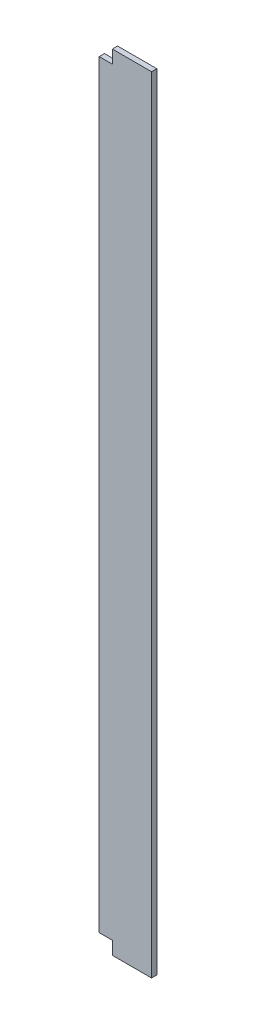
ISO-10303-21;
HEADER;
FILE_DESCRIPTION(('STEP AP214'),'2;1');
FILE_NAME('part.step','',(''),(''),'','','');
FILE_SCHEMA(('AUTOMOTIVE_DESIGN { 1 0 10303 214 1 1 1 1 }'));
ENDSEC;
DATA;
#1=APPLICATION_CONTEXT('core data for automotive mechanical design processes');
#2=APPLICATION_PROTOCOL_DEFINITION('international standard','automotive_design',2000,#1);
#3=PRODUCT_CONTEXT('',#1,'mechanical');
#4=PRODUCT('Part','Part','',(#3));
#5=PRODUCT_RELATED_PRODUCT_CATEGORY('part','',(#4));
#6=PRODUCT_DEFINITION_FORMATION('','',#4);
#7=PRODUCT_DEFINITION_CONTEXT('part definition',#1,'design');
#8=PRODUCT_DEFINITION('design','',#6,#7);
#9=PRODUCT_DEFINITION_SHAPE('','',#8);
#10=(LENGTH_UNIT() NAMED_UNIT(*) SI_UNIT(.MILLI.,.METRE.));
#11=(NAMED_UNIT(*) PLANE_ANGLE_UNIT() SI_UNIT($,.RADIAN.));
#12=(NAMED_UNIT(*) SI_UNIT($,.STERADIAN.) SOLID_ANGLE_UNIT());
#13=UNCERTAINTY_MEASURE_WITH_UNIT(LENGTH_MEASURE(1.E-05),#10,'distance_accuracy_value','');
#14=(GEOMETRIC_REPRESENTATION_CONTEXT(3) GLOBAL_UNCERTAINTY_ASSIGNED_CONTEXT((#13)) GLOBAL_UNIT_ASSIGNED_CONTEXT((#10,
#11,#12)) REPRESENTATION_CONTEXT('',''));
#15=CARTESIAN_POINT('',(0.,0.,0.));
#16=DIRECTION('',(0.,0.,1.));
#17=DIRECTION('',(1.,0.,0.));
#18=AXIS2_PLACEMENT_3D('',#15,#16,#17);
#19=CARTESIAN_POINT('',(-1156.48368854433,3000.,-804.687242443019));
#20=DIRECTION('',(1.,0.,0.));
#21=DIRECTION('',(0.,0.,-1.));
#22=AXIS2_PLACEMENT_3D('',#19,#20,#21);
#23=PLANE('',#22);
#24=DIRECTION('',(0.,-1.,0.));
#25=VECTOR('',#24,1.);
#26=CARTESIAN_POINT('',(-1156.48368854433,3000.,-784.687242443019));
#27=LINE('',#26,#25);
#28=CARTESIAN_POINT('',(-1156.48368854433,2950.,-784.687242443019));
#29=VERTEX_POINT('',#28);
#30=CARTESIAN_POINT('',(-1156.48368854433,50.,-784.687242443019));
#31=VERTEX_POINT('',#30);
#32=EDGE_CURVE('E11',#29,#31,#27,.T.);
#33=ORIENTED_EDGE('',*,*,#32,.F.);
#34=DIRECTION('',(0.,0.,1.));
#35=VECTOR('',#34,1.);
#36=CARTESIAN_POINT('',(-1156.48368854433,2950.,-804.687242443019));
#37=LINE('',#36,#35);
#38=CARTESIAN_POINT('',(-1156.48368854433,2950.,-804.687242443019));
#39=VERTEX_POINT('',#38);
#40=EDGE_CURVE('E109',#39,#29,#37,.T.);
#41=ORIENTED_EDGE('',*,*,#40,.F.);
#42=DIRECTION('',(0.,-1.,0.));
#43=VECTOR('',#42,1.);
#44=CARTESIAN_POINT('',(-1156.48368854433,3000.,-804.687242443019));
#45=LINE('',#44,#43);
#46=CARTESIAN_POINT('',(-1156.48368854433,50.,-804.687242443019));
#47=VERTEX_POINT('',#46);
#48=EDGE_CURVE('E126',#39,#47,#45,.T.);
#49=ORIENTED_EDGE('',*,*,#48,.T.);
#50=DIRECTION('',(0.,0.,1.));
#51=VECTOR('',#50,1.);
#52=CARTESIAN_POINT('',(-1156.48368854433,50.,-804.687242443019));
#53=LINE('',#52,#51);
#54=EDGE_CURVE('E180',#47,#31,#53,.T.);
#55=ORIENTED_EDGE('',*,*,#54,.T.);
#56=EDGE_LOOP('',(#33,#41,#49,#55));
#57=FACE_BOUND('',#56,.T.);
#58=ADVANCED_FACE('F38',(#57),#23,.F.);
#59=CARTESIAN_POINT('',(-1156.48368854433,3000.,-784.687242443019));
#60=DIRECTION('',(0.,0.,-1.));
#61=DIRECTION('',(-1.,0.,0.));
#62=AXIS2_PLACEMENT_3D('',#59,#60,#61);
#63=PLANE('',#62);
#64=DIRECTION('',(1.,0.,0.));
#65=VECTOR('',#64,1.);
#66=CARTESIAN_POINT('',(-1156.48368854433,3000.,-784.687242443019));
#67=LINE('',#66,#65);
#68=CARTESIAN_POINT('',(-1106.48368854433,3000.,-784.687242443019));
#69=VERTEX_POINT('',#68);
#70=CARTESIAN_POINT('',(-956.483688544326,3000.,-784.687242443019));
#71=VERTEX_POINT('',#70);
#72=EDGE_CURVE('E132',#69,#71,#67,.T.);
#73=ORIENTED_EDGE('',*,*,#72,.F.);
#74=DIRECTION('',(0.,1.,0.));
#75=VECTOR('',#74,1.);
#76=CARTESIAN_POINT('',(-1106.48368854433,3000.,-784.687242443019));
#77=LINE('',#76,#75);
#78=CARTESIAN_POINT('',(-1106.48368854433,2950.,-784.687242443019));
#79=VERTEX_POINT('',#78);
#80=EDGE_CURVE('E53',#79,#69,#77,.T.);
#81=ORIENTED_EDGE('',*,*,#80,.F.);
#82=DIRECTION('',(1.,0.,0.));
#83=VECTOR('',#82,1.);
#84=CARTESIAN_POINT('',(-1106.48368854433,2950.,-784.687242443019));
#85=LINE('',#84,#83);
#86=EDGE_CURVE('E119',#29,#79,#85,.T.);
#87=ORIENTED_EDGE('',*,*,#86,.F.);
#88=ORIENTED_EDGE('',*,*,#32,.T.);
#89=DIRECTION('',(-1.,0.,0.));
#90=VECTOR('',#89,1.);
#91=CARTESIAN_POINT('',(-1106.48368854433,50.,-784.687242443019));
#92=LINE('',#91,#90);
#93=CARTESIAN_POINT('',(-1106.48368854433,50.,-784.687242443019));
#94=VERTEX_POINT('',#93);
#95=EDGE_CURVE('E163',#94,#31,#92,.T.);
#96=ORIENTED_EDGE('',*,*,#95,.F.);
#97=DIRECTION('',(0.,1.,0.));
#98=VECTOR('',#97,1.);
#99=CARTESIAN_POINT('',(-1106.48368854433,0.,-784.687242443019));
#100=LINE('',#99,#98);
#101=CARTESIAN_POINT('',(-1106.48368854433,0.,-784.687242443019));
#102=VERTEX_POINT('',#101);
#103=EDGE_CURVE('E170',#102,#94,#100,.T.);
#104=ORIENTED_EDGE('',*,*,#103,.F.);
#105=DIRECTION('',(1.,0.,0.));
#106=VECTOR('',#105,1.);
#107=CARTESIAN_POINT('',(-1156.48368854433,0.,-784.687242443019));
#108=LINE('',#107,#106);
#109=CARTESIAN_POINT('',(-956.483688544326,0.,-784.687242443019));
#110=VERTEX_POINT('',#109);
#111=EDGE_CURVE('E136',#102,#110,#108,.T.);
#112=ORIENTED_EDGE('',*,*,#111,.T.);
#113=DIRECTION('',(0.,-1.,0.));
#114=VECTOR('',#113,1.);
#115=CARTESIAN_POINT('',(-956.483688544326,3000.,-784.687242443019));
#116=LINE('',#115,#114);
#117=EDGE_CURVE('E46',#71,#110,#116,.T.);
#118=ORIENTED_EDGE('',*,*,#117,.F.);
#119=EDGE_LOOP('',(#73,#81,#87,#88,#96,#104,#112,#118));
#120=FACE_BOUND('',#119,.T.);
#121=ADVANCED_FACE('F186',(#120),#63,.F.);
#122=CARTESIAN_POINT('',(-956.483688544326,3000.,-804.687242443019));
#123=DIRECTION('',(1.,0.,0.));
#124=DIRECTION('',(0.,0.,-1.));
#125=AXIS2_PLACEMENT_3D('',#122,#123,#124);
#126=PLANE('',#125);
#127=DIRECTION('',(0.,0.,1.));
#128=VECTOR('',#127,1.);
#129=CARTESIAN_POINT('',(-956.483688544326,0.,-804.687242443019));
#130=LINE('',#129,#128);
#131=CARTESIAN_POINT('',(-956.483688544326,0.,-804.687242443019));
#132=VERTEX_POINT('',#131);
#133=EDGE_CURVE('E139',#132,#110,#130,.T.);
#134=ORIENTED_EDGE('',*,*,#133,.F.);
#135=DIRECTION('',(0.,-1.,0.));
#136=VECTOR('',#135,1.);
#137=CARTESIAN_POINT('',(-956.483688544326,3000.,-804.687242443019));
#138=LINE('',#137,#136);
#139=CARTESIAN_POINT('',(-956.483688544326,3000.,-804.687242443019));
#140=VERTEX_POINT('',#139);
#141=EDGE_CURVE('E130',#140,#132,#138,.T.);
#142=ORIENTED_EDGE('',*,*,#141,.F.);
#143=DIRECTION('',(0.,0.,1.));
#144=VECTOR('',#143,1.);
#145=CARTESIAN_POINT('',(-956.483688544326,3000.,-804.687242443019));
#146=LINE('',#145,#144);
#147=EDGE_CURVE('E124',#140,#71,#146,.T.);
#148=ORIENTED_EDGE('',*,*,#147,.T.);
#149=ORIENTED_EDGE('',*,*,#117,.T.);
#150=EDGE_LOOP('',(#134,#142,#148,#149));
#151=FACE_BOUND('',#150,.T.);
#152=ADVANCED_FACE('F153',(#151),#126,.T.);
#153=CARTESIAN_POINT('',(-1156.48368854433,3000.,-804.687242443019));
#154=DIRECTION('',(0.,0.,-1.));
#155=DIRECTION('',(-1.,0.,0.));
#156=AXIS2_PLACEMENT_3D('',#153,#154,#155);
#157=PLANE('',#156);
#158=DIRECTION('',(0.,1.,0.));
#159=VECTOR('',#158,1.);
#160=CARTESIAN_POINT('',(-1106.48368854433,3000.,-804.687242443019));
#161=LINE('',#160,#159);
#162=CARTESIAN_POINT('',(-1106.48368854433,2950.,-804.687242443019));
#163=VERTEX_POINT('',#162);
#164=CARTESIAN_POINT('',(-1106.48368854433,3000.,-804.687242443019));
#165=VERTEX_POINT('',#164);
#166=EDGE_CURVE('E103',#163,#165,#161,.T.);
#167=ORIENTED_EDGE('',*,*,#166,.T.);
#168=DIRECTION('',(1.,0.,0.));
#169=VECTOR('',#168,1.);
#170=CARTESIAN_POINT('',(-1156.48368854433,3000.,-804.687242443019));
#171=LINE('',#170,#169);
#172=EDGE_CURVE('E115',#165,#140,#171,.T.);
#173=ORIENTED_EDGE('',*,*,#172,.T.);
#174=ORIENTED_EDGE('',*,*,#141,.T.);
#175=DIRECTION('',(1.,0.,0.));
#176=VECTOR('',#175,1.);
#177=CARTESIAN_POINT('',(-1156.48368854433,0.,-804.687242443019));
#178=LINE('',#177,#176);
#179=CARTESIAN_POINT('',(-1106.48368854433,0.,-804.687242443019));
#180=VERTEX_POINT('',#179);
#181=EDGE_CURVE('E144',#180,#132,#178,.T.);
#182=ORIENTED_EDGE('',*,*,#181,.F.);
#183=DIRECTION('',(0.,1.,0.));
#184=VECTOR('',#183,1.);
#185=CARTESIAN_POINT('',(-1106.48368854433,0.,-804.687242443019));
#186=LINE('',#185,#184);
#187=CARTESIAN_POINT('',(-1106.48368854433,50.,-804.687242443019));
#188=VERTEX_POINT('',#187);
#189=EDGE_CURVE('E61',#180,#188,#186,.T.);
#190=ORIENTED_EDGE('',*,*,#189,.T.);
#191=DIRECTION('',(-1.,0.,0.));
#192=VECTOR('',#191,1.);
#193=CARTESIAN_POINT('',(-1106.48368854433,50.,-804.687242443019));
#194=LINE('',#193,#192);
#195=EDGE_CURVE('E161',#188,#47,#194,.T.);
#196=ORIENTED_EDGE('',*,*,#195,.T.);
#197=ORIENTED_EDGE('',*,*,#48,.F.);
#198=DIRECTION('',(1.,0.,0.));
#199=VECTOR('',#198,1.);
#200=CARTESIAN_POINT('',(-1106.48368854433,2950.,-804.687242443019));
#201=LINE('',#200,#199);
#202=EDGE_CURVE('E110',#39,#163,#201,.T.);
#203=ORIENTED_EDGE('',*,*,#202,.T.);
#204=EDGE_LOOP('',(#167,#173,#174,#182,#190,#196,#197,#203));
#205=FACE_BOUND('',#204,.T.);
#206=ADVANCED_FACE('F113',(#205),#157,.T.);
#207=CARTESIAN_POINT('',(0.,3000.,0.));
#208=DIRECTION('',(0.,1.,0.));
#209=DIRECTION('',(0.,0.,1.));
#210=AXIS2_PLACEMENT_3D('',#207,#208,#209);
#211=PLANE('',#210);
#212=DIRECTION('',(0.,0.,1.));
#213=VECTOR('',#212,1.);
#214=CARTESIAN_POINT('',(-1106.48368854433,3000.,-804.687242443019));
#215=LINE('',#214,#213);
#216=EDGE_CURVE('E100',#165,#69,#215,.T.);
#217=ORIENTED_EDGE('',*,*,#216,.T.);
#218=ORIENTED_EDGE('',*,*,#72,.T.);
#219=ORIENTED_EDGE('',*,*,#147,.F.);
#220=ORIENTED_EDGE('',*,*,#172,.F.);
#221=EDGE_LOOP('',(#217,#218,#219,#220));
#222=FACE_BOUND('',#221,.T.);
#223=ADVANCED_FACE('F122',(#222),#211,.T.);
#224=CARTESIAN_POINT('',(0.,0.,0.));
#225=DIRECTION('',(0.,1.,0.));
#226=DIRECTION('',(0.,0.,1.));
#227=AXIS2_PLACEMENT_3D('',#224,#225,#226);
#228=PLANE('',#227);
#229=ORIENTED_EDGE('',*,*,#111,.F.);
#230=DIRECTION('',(0.,0.,1.));
#231=VECTOR('',#230,1.);
#232=CARTESIAN_POINT('',(-1106.48368854433,0.,-804.687242443019));
#233=LINE('',#232,#231);
#234=EDGE_CURVE('E140',#180,#102,#233,.T.);
#235=ORIENTED_EDGE('',*,*,#234,.F.);
#236=ORIENTED_EDGE('',*,*,#181,.T.);
#237=ORIENTED_EDGE('',*,*,#133,.T.);
#238=EDGE_LOOP('',(#229,#235,#236,#237));
#239=FACE_BOUND('',#238,.T.);
#240=ADVANCED_FACE('F157',(#239),#228,.F.);
#241=CARTESIAN_POINT('',(-1106.48368854433,0.,-804.687242443019));
#242=DIRECTION('',(1.,0.,0.));
#243=DIRECTION('',(0.,0.,-1.));
#244=AXIS2_PLACEMENT_3D('',#241,#242,#243);
#245=PLANE('',#244);
#246=ORIENTED_EDGE('',*,*,#103,.T.);
#247=DIRECTION('',(0.,0.,1.));
#248=VECTOR('',#247,1.);
#249=CARTESIAN_POINT('',(-1106.48368854433,50.,-804.687242443019));
#250=LINE('',#249,#248);
#251=EDGE_CURVE('E167',#188,#94,#250,.T.);
#252=ORIENTED_EDGE('',*,*,#251,.F.);
#253=ORIENTED_EDGE('',*,*,#189,.F.);
#254=ORIENTED_EDGE('',*,*,#234,.T.);
#255=EDGE_LOOP('',(#246,#252,#253,#254));
#256=FACE_BOUND('',#255,.T.);
#257=ADVANCED_FACE('F207',(#256),#245,.F.);
#258=CARTESIAN_POINT('',(-1106.48368854433,50.,-804.687242443019));
#259=DIRECTION('',(0.,1.,0.));
#260=DIRECTION('',(-1.,0.,0.));
#261=AXIS2_PLACEMENT_3D('',#258,#259,#260);
#262=PLANE('',#261);
#263=ORIENTED_EDGE('',*,*,#95,.T.);
#264=ORIENTED_EDGE('',*,*,#54,.F.);
#265=ORIENTED_EDGE('',*,*,#195,.F.);
#266=ORIENTED_EDGE('',*,*,#251,.T.);
#267=EDGE_LOOP('',(#263,#264,#265,#266));
#268=FACE_BOUND('',#267,.T.);
#269=ADVANCED_FACE('F206',(#268),#262,.F.);
#270=CARTESIAN_POINT('',(-1106.48368854433,3000.,-804.687242443019));
#271=DIRECTION('',(1.,0.,0.));
#272=DIRECTION('',(0.,0.,-1.));
#273=AXIS2_PLACEMENT_3D('',#270,#271,#272);
#274=PLANE('',#273);
#275=ORIENTED_EDGE('',*,*,#80,.T.);
#276=ORIENTED_EDGE('',*,*,#216,.F.);
#277=ORIENTED_EDGE('',*,*,#166,.F.);
#278=DIRECTION('',(0.,0.,1.));
#279=VECTOR('',#278,1.);
#280=CARTESIAN_POINT('',(-1106.48368854433,2950.,-804.687242443019));
#281=LINE('',#280,#279);
#282=EDGE_CURVE('E176',#163,#79,#281,.T.);
#283=ORIENTED_EDGE('',*,*,#282,.T.);
#284=EDGE_LOOP('',(#275,#276,#277,#283));
#285=FACE_BOUND('',#284,.T.);
#286=ADVANCED_FACE('F102',(#285),#274,.F.);
#287=CARTESIAN_POINT('',(-1106.48368854433,2950.,-804.687242443019));
#288=DIRECTION('',(0.,-1.,0.));
#289=DIRECTION('',(0.,0.,-1.));
#290=AXIS2_PLACEMENT_3D('',#287,#288,#289);
#291=PLANE('',#290);
#292=ORIENTED_EDGE('',*,*,#86,.T.);
#293=ORIENTED_EDGE('',*,*,#282,.F.);
#294=ORIENTED_EDGE('',*,*,#202,.F.);
#295=ORIENTED_EDGE('',*,*,#40,.T.);
#296=EDGE_LOOP('',(#292,#293,#294,#295));
#297=FACE_BOUND('',#296,.T.);
#298=ADVANCED_FACE('F200',(#297),#291,.F.);
#299=CLOSED_SHELL('',(#58,#121,#152,#206,#223,#240,#257,#269,#286,#298));
#300=MANIFOLD_SOLID_BREP('B2',#299);
#301=ADVANCED_BREP_SHAPE_REPRESENTATION('',(#18,#300),#14);
#302=SHAPE_DEFINITION_REPRESENTATION(#9,#301);
ENDSEC;
END-ISO-10303-21;
